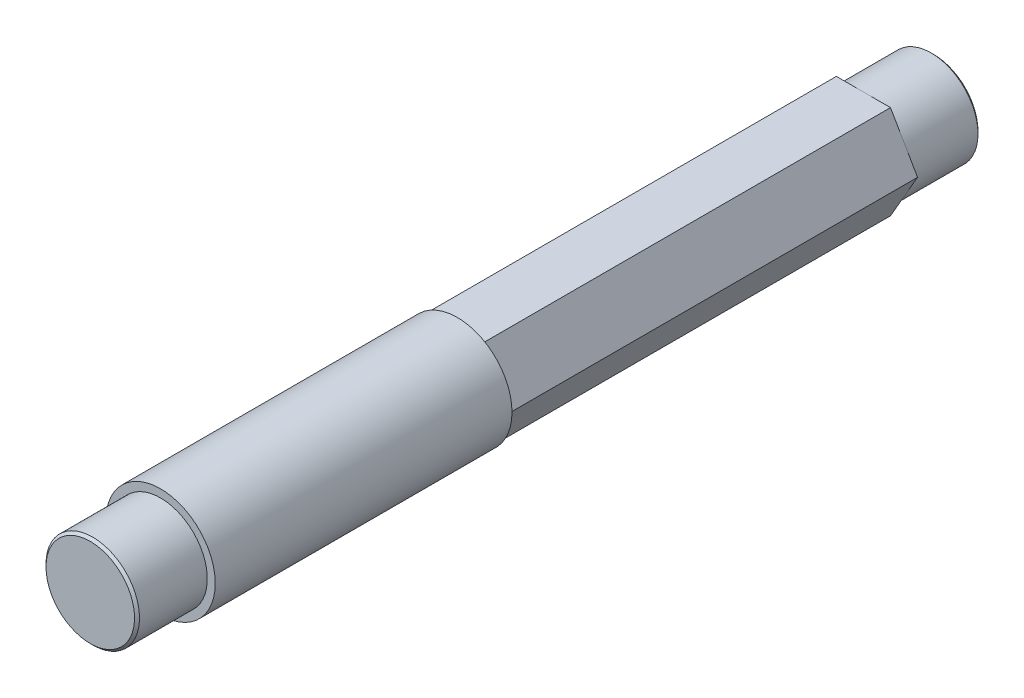
ISO-10303-21;
HEADER;
FILE_DESCRIPTION(('STEP AP214'),'2;1');
FILE_NAME('part.step','',(''),(''),'','','');
FILE_SCHEMA(('AUTOMOTIVE_DESIGN { 1 0 10303 214 1 1 1 1 }'));
ENDSEC;
DATA;
#1=APPLICATION_CONTEXT('core data for automotive mechanical design processes');
#2=APPLICATION_PROTOCOL_DEFINITION('international standard','automotive_design',2000,#1);
#3=PRODUCT_CONTEXT('',#1,'mechanical');
#4=PRODUCT('Part','Part','',(#3));
#5=PRODUCT_RELATED_PRODUCT_CATEGORY('part','',(#4));
#6=PRODUCT_DEFINITION_FORMATION('','',#4);
#7=PRODUCT_DEFINITION_CONTEXT('part definition',#1,'design');
#8=PRODUCT_DEFINITION('design','',#6,#7);
#9=PRODUCT_DEFINITION_SHAPE('','',#8);
#10=(LENGTH_UNIT() NAMED_UNIT(*) SI_UNIT(.MILLI.,.METRE.));
#11=(NAMED_UNIT(*) PLANE_ANGLE_UNIT() SI_UNIT($,.RADIAN.));
#12=(NAMED_UNIT(*) SI_UNIT($,.STERADIAN.) SOLID_ANGLE_UNIT());
#13=UNCERTAINTY_MEASURE_WITH_UNIT(LENGTH_MEASURE(1.E-05),#10,'distance_accuracy_value','');
#14=(GEOMETRIC_REPRESENTATION_CONTEXT(3) GLOBAL_UNCERTAINTY_ASSIGNED_CONTEXT((#13)) GLOBAL_UNIT_ASSIGNED_CONTEXT((#10,
#11,#12)) REPRESENTATION_CONTEXT('',''));
#15=CARTESIAN_POINT('',(0.,0.,0.));
#16=DIRECTION('',(0.,0.,1.));
#17=DIRECTION('',(1.,0.,0.));
#18=AXIS2_PLACEMENT_3D('',#15,#16,#17);
#19=CARTESIAN_POINT('',(0.,0.,-42.8625));
#20=DIRECTION('',(0.,0.,-1.));
#21=DIRECTION('',(-1.,0.,0.));
#22=AXIS2_PLACEMENT_3D('',#19,#20,#21);
#23=PLANE('',#22);
#24=CARTESIAN_POINT('',(0.,0.,-42.8625000000125));
#25=DIRECTION('',(0.,0.,1.));
#26=DIRECTION('',(1.,0.,0.));
#27=AXIS2_PLACEMENT_3D('',#24,#25,#26);
#28=CIRCLE('',#27,4.49980000001915);
#29=CARTESIAN_POINT('',(4.49980000001915,0.,-42.8625000000125));
#30=VERTEX_POINT('',#29);
#31=EDGE_CURVE('E20',#30,#30,#28,.T.);
#32=ORIENTED_EDGE('',*,*,#31,.F.);
#33=EDGE_LOOP('',(#32));
#34=FACE_BOUND('',#33,.T.);
#35=ADVANCED_FACE('F17',(#34),#23,.T.);
#36=CARTESIAN_POINT('',(0.,0.,-42.6125000000752));
#37=DIRECTION('',(0.,0.,1.));
#38=DIRECTION('',(1.,0.,0.));
#39=AXIS2_PLACEMENT_3D('',#36,#37,#38);
#40=CONICAL_SURFACE('',#39,4.74979999995639,0.785398163397448);
#41=CARTESIAN_POINT('',(0.,0.,-42.6125));
#42=DIRECTION('',(0.,0.,1.));
#43=DIRECTION('',(1.,0.,0.));
#44=AXIS2_PLACEMENT_3D('',#41,#42,#43);
#45=CIRCLE('',#44,4.7498);
#46=CARTESIAN_POINT('',(4.7498,0.,-42.6125));
#47=VERTEX_POINT('',#46);
#48=EDGE_CURVE('E102',#47,#47,#45,.T.);
#49=ORIENTED_EDGE('',*,*,#48,.F.);
#50=EDGE_LOOP('',(#49));
#51=FACE_BOUND('',#50,.T.);
#52=ORIENTED_EDGE('',*,*,#31,.T.);
#53=EDGE_LOOP('',(#52));
#54=FACE_BOUND('',#53,.T.);
#55=ADVANCED_FACE('F255',(#51,#54),#40,.T.);
#56=CARTESIAN_POINT('',(0.,0.,-42.8625));
#57=DIRECTION('',(0.,0.,1.));
#58=DIRECTION('',(1.,0.,0.));
#59=AXIS2_PLACEMENT_3D('',#56,#57,#58);
#60=CYLINDRICAL_SURFACE('',#59,4.7498);
#61=CARTESIAN_POINT('',(0.,0.,-35.71875));
#62=DIRECTION('',(0.,0.,1.));
#63=DIRECTION('',(1.,0.,0.));
#64=AXIS2_PLACEMENT_3D('',#61,#62,#63);
#65=CIRCLE('',#64,4.7498);
#66=CARTESIAN_POINT('',(4.7498,0.,-35.71875));
#67=VERTEX_POINT('',#66);
#68=EDGE_CURVE('E104',#67,#67,#65,.F.);
#69=ORIENTED_EDGE('',*,*,#68,.T.);
#70=EDGE_LOOP('',(#69));
#71=FACE_BOUND('',#70,.T.);
#72=ORIENTED_EDGE('',*,*,#48,.T.);
#73=EDGE_LOOP('',(#72));
#74=FACE_BOUND('',#73,.T.);
#75=ADVANCED_FACE('F116',(#71,#74),#60,.T.);
#76=CARTESIAN_POINT('',(0.,0.,42.8625));
#77=DIRECTION('',(0.,0.,1.));
#78=DIRECTION('',(1.,0.,0.));
#79=AXIS2_PLACEMENT_3D('',#76,#77,#78);
#80=PLANE('',#79);
#81=CARTESIAN_POINT('',(0.,0.,42.8625000000125));
#82=DIRECTION('',(0.,0.,-1.));
#83=DIRECTION('',(-1.,0.,0.));
#84=AXIS2_PLACEMENT_3D('',#81,#82,#83);
#85=CIRCLE('',#84,4.49980000001915);
#86=CARTESIAN_POINT('',(-4.49980000001915,0.,42.8625000000125));
#87=VERTEX_POINT('',#86);
#88=EDGE_CURVE('E80',#87,#87,#85,.T.);
#89=ORIENTED_EDGE('',*,*,#88,.F.);
#90=EDGE_LOOP('',(#89));
#91=FACE_BOUND('',#90,.T.);
#92=ADVANCED_FACE('F120',(#91),#80,.T.);
#93=CARTESIAN_POINT('',(0.,0.,-35.71875));
#94=DIRECTION('',(0.,0.,1.));
#95=DIRECTION('',(1.,0.,0.));
#96=AXIS2_PLACEMENT_3D('',#93,#94,#95);
#97=PLANE('',#96);
#98=DIRECTION('',(1.,0.,0.));
#99=VECTOR('',#98,1.);
#100=CARTESIAN_POINT('',(-2.7496306570156,-4.76250000000002,-35.71875));
#101=LINE('',#100,#99);
#102=CARTESIAN_POINT('',(2.74963065701558,-4.76250000000002,-35.71875));
#103=VERTEX_POINT('',#102);
#104=CARTESIAN_POINT('',(-2.7496306570156,-4.76250000000002,-35.71875));
#105=VERTEX_POINT('',#104);
#106=EDGE_CURVE('E76',#103,#105,#101,.F.);
#107=ORIENTED_EDGE('',*,*,#106,.T.);
#108=DIRECTION('',(-0.499999999999999,0.866025403784439,0.));
#109=VECTOR('',#108,1.);
#110=CARTESIAN_POINT('',(-5.49926131403121,0.,-35.71875));
#111=LINE('',#110,#109);
#112=CARTESIAN_POINT('',(-5.49926131403121,0.,-35.71875));
#113=VERTEX_POINT('',#112);
#114=EDGE_CURVE('E71',#105,#113,#111,.T.);
#115=ORIENTED_EDGE('',*,*,#114,.T.);
#116=DIRECTION('',(0.5,0.866025403784439,0.));
#117=VECTOR('',#116,1.);
#118=CARTESIAN_POINT('',(-2.7496306570156,4.76250000000003,-35.71875));
#119=LINE('',#118,#117);
#120=CARTESIAN_POINT('',(-2.7496306570156,4.76250000000003,-35.71875));
#121=VERTEX_POINT('',#120);
#122=EDGE_CURVE('E68',#113,#121,#119,.T.);
#123=ORIENTED_EDGE('',*,*,#122,.T.);
#124=DIRECTION('',(1.,0.,0.));
#125=VECTOR('',#124,1.);
#126=CARTESIAN_POINT('',(2.74963065701557,4.76250000000003,-35.71875));
#127=LINE('',#126,#125);
#128=CARTESIAN_POINT('',(2.74963065701557,4.76250000000003,-35.71875));
#129=VERTEX_POINT('',#128);
#130=EDGE_CURVE('E94',#121,#129,#127,.T.);
#131=ORIENTED_EDGE('',*,*,#130,.T.);
#132=DIRECTION('',(0.5,-0.866025403784439,0.));
#133=VECTOR('',#132,1.);
#134=CARTESIAN_POINT('',(5.49926131403118,0.,-35.71875));
#135=LINE('',#134,#133);
#136=CARTESIAN_POINT('',(5.49926131403118,0.,-35.71875));
#137=VERTEX_POINT('',#136);
#138=EDGE_CURVE('E291',#129,#137,#135,.T.);
#139=ORIENTED_EDGE('',*,*,#138,.T.);
#140=DIRECTION('',(-0.499999999999999,-0.866025403784439,0.));
#141=VECTOR('',#140,1.);
#142=CARTESIAN_POINT('',(2.74963065701558,-4.76250000000002,-35.71875));
#143=LINE('',#142,#141);
#144=EDGE_CURVE('E297',#137,#103,#143,.T.);
#145=ORIENTED_EDGE('',*,*,#144,.T.);
#146=EDGE_LOOP('',(#107,#115,#123,#131,#139,#145));
#147=FACE_BOUND('',#146,.T.);
#148=ORIENTED_EDGE('',*,*,#68,.F.);
#149=EDGE_LOOP('',(#148));
#150=FACE_BOUND('',#149,.T.);
#151=ADVANCED_FACE('F73',(#147,#150),#97,.F.);
#152=CARTESIAN_POINT('',(0.,0.,42.6125000000752));
#153=DIRECTION('',(0.,0.,-1.));
#154=DIRECTION('',(-1.,0.,0.));
#155=AXIS2_PLACEMENT_3D('',#152,#153,#154);
#156=CONICAL_SURFACE('',#155,4.74979999995639,0.785398163397448);
#157=CARTESIAN_POINT('',(0.,0.,42.6125));
#158=DIRECTION('',(0.,0.,-1.));
#159=DIRECTION('',(-1.,0.,0.));
#160=AXIS2_PLACEMENT_3D('',#157,#158,#159);
#161=CIRCLE('',#160,4.7498);
#162=CARTESIAN_POINT('',(-4.7498,0.,42.6125));
#163=VERTEX_POINT('',#162);
#164=EDGE_CURVE('E98',#163,#163,#161,.T.);
#165=ORIENTED_EDGE('',*,*,#164,.F.);
#166=EDGE_LOOP('',(#165));
#167=FACE_BOUND('',#166,.T.);
#168=ORIENTED_EDGE('',*,*,#88,.T.);
#169=EDGE_LOOP('',(#168));
#170=FACE_BOUND('',#169,.T.);
#171=ADVANCED_FACE('F119',(#167,#170),#156,.T.);
#172=CARTESIAN_POINT('',(-5.49926131403121,0.,35.71875));
#173=DIRECTION('',(0.866025403784439,0.499999999999999,0.));
#174=DIRECTION('',(-0.499999999999999,0.866025403784439,0.));
#175=AXIS2_PLACEMENT_3D('',#172,#173,#174);
#176=PLANE('',#175);
#177=DIRECTION('',(0.,0.,1.));
#178=VECTOR('',#177,1.);
#179=CARTESIAN_POINT('',(-5.49926131403121,0.,35.71875));
#180=LINE('',#179,#178);
#181=CARTESIAN_POINT('',(-5.49926131403121,0.,5.55625));
#182=VERTEX_POINT('',#181);
#183=EDGE_CURVE('E79',#182,#113,#180,.F.);
#184=ORIENTED_EDGE('',*,*,#183,.T.);
#185=ORIENTED_EDGE('',*,*,#114,.F.);
#186=DIRECTION('',(0.,0.,1.));
#187=VECTOR('',#186,1.);
#188=CARTESIAN_POINT('',(-2.7496306570156,-4.76250000000002,35.71875));
#189=LINE('',#188,#187);
#190=CARTESIAN_POINT('',(-2.7496306570156,-4.76250000000002,5.55625));
#191=VERTEX_POINT('',#190);
#192=EDGE_CURVE('E101',#105,#191,#189,.T.);
#193=ORIENTED_EDGE('',*,*,#192,.T.);
#194=DIRECTION('',(-0.5,0.866025403784439,0.));
#195=VECTOR('',#194,1.);
#196=CARTESIAN_POINT('',(-2.7496306570156,-4.76250000000002,5.55625));
#197=LINE('',#196,#195);
#198=EDGE_CURVE('E85',#191,#182,#197,.T.);
#199=ORIENTED_EDGE('',*,*,#198,.T.);
#200=EDGE_LOOP('',(#184,#185,#193,#199));
#201=FACE_BOUND('',#200,.T.);
#202=ADVANCED_FACE('F83',(#201),#176,.F.);
#203=CARTESIAN_POINT('',(-2.7496306570156,4.76250000000003,35.71875));
#204=DIRECTION('',(0.866025403784439,-0.5,0.));
#205=DIRECTION('',(0.5,0.866025403784439,0.));
#206=AXIS2_PLACEMENT_3D('',#203,#204,#205);
#207=PLANE('',#206);
#208=DIRECTION('',(0.,0.,-1.));
#209=VECTOR('',#208,1.);
#210=CARTESIAN_POINT('',(-2.7496306570156,4.76250000000003,35.71875));
#211=LINE('',#210,#209);
#212=CARTESIAN_POINT('',(-2.7496306570156,4.76250000000003,5.55625));
#213=VERTEX_POINT('',#212);
#214=EDGE_CURVE('E91',#213,#121,#211,.T.);
#215=ORIENTED_EDGE('',*,*,#214,.T.);
#216=ORIENTED_EDGE('',*,*,#122,.F.);
#217=ORIENTED_EDGE('',*,*,#183,.F.);
#218=DIRECTION('',(0.5,0.866025403784439,0.));
#219=VECTOR('',#218,1.);
#220=CARTESIAN_POINT('',(-5.49926131403121,0.,5.55625));
#221=LINE('',#220,#219);
#222=EDGE_CURVE('E306',#182,#213,#221,.T.);
#223=ORIENTED_EDGE('',*,*,#222,.T.);
#224=EDGE_LOOP('',(#215,#216,#217,#223));
#225=FACE_BOUND('',#224,.T.);
#226=ADVANCED_FACE('F89',(#225),#207,.F.);
#227=CARTESIAN_POINT('',(2.74963065701557,4.76250000000003,35.71875));
#228=DIRECTION('',(0.,-1.,0.));
#229=DIRECTION('',(0.,0.,-1.));
#230=AXIS2_PLACEMENT_3D('',#227,#228,#229);
#231=PLANE('',#230);
#232=DIRECTION('',(0.,0.,1.));
#233=VECTOR('',#232,1.);
#234=CARTESIAN_POINT('',(2.74963065701557,4.76250000000003,35.71875));
#235=LINE('',#234,#233);
#236=CARTESIAN_POINT('',(2.74963065701557,4.76250000000003,5.55625));
#237=VERTEX_POINT('',#236);
#238=EDGE_CURVE('E286',#237,#129,#235,.F.);
#239=ORIENTED_EDGE('',*,*,#238,.T.);
#240=ORIENTED_EDGE('',*,*,#130,.F.);
#241=ORIENTED_EDGE('',*,*,#214,.F.);
#242=DIRECTION('',(1.,0.,0.));
#243=VECTOR('',#242,1.);
#244=CARTESIAN_POINT('',(0.,4.76250000000003,5.55625));
#245=LINE('',#244,#243);
#246=EDGE_CURVE('E289',#213,#237,#245,.T.);
#247=ORIENTED_EDGE('',*,*,#246,.T.);
#248=EDGE_LOOP('',(#239,#240,#241,#247));
#249=FACE_BOUND('',#248,.T.);
#250=ADVANCED_FACE('F161',(#249),#231,.F.);
#251=CARTESIAN_POINT('',(5.49926131403118,0.,35.71875));
#252=DIRECTION('',(-0.866025403784439,-0.5,0.));
#253=DIRECTION('',(0.5,-0.866025403784439,0.));
#254=AXIS2_PLACEMENT_3D('',#251,#252,#253);
#255=PLANE('',#254);
#256=DIRECTION('',(0.,0.,1.));
#257=VECTOR('',#256,1.);
#258=CARTESIAN_POINT('',(5.49926131403118,0.,35.71875));
#259=LINE('',#258,#257);
#260=CARTESIAN_POINT('',(5.49926131403118,0.,5.55624999999999));
#261=VERTEX_POINT('',#260);
#262=EDGE_CURVE('E294',#261,#137,#259,.F.);
#263=ORIENTED_EDGE('',*,*,#262,.T.);
#264=ORIENTED_EDGE('',*,*,#138,.F.);
#265=ORIENTED_EDGE('',*,*,#238,.F.);
#266=DIRECTION('',(0.5,-0.866025403784439,0.));
#267=VECTOR('',#266,1.);
#268=CARTESIAN_POINT('',(2.74963065701557,4.76250000000003,5.55625));
#269=LINE('',#268,#267);
#270=EDGE_CURVE('E309',#237,#261,#269,.T.);
#271=ORIENTED_EDGE('',*,*,#270,.T.);
#272=EDGE_LOOP('',(#263,#264,#265,#271));
#273=FACE_BOUND('',#272,.T.);
#274=ADVANCED_FACE('F158',(#273),#255,.F.);
#275=CARTESIAN_POINT('',(2.74963065701558,-4.76250000000002,35.71875));
#276=DIRECTION('',(-0.866025403784439,0.499999999999999,0.));
#277=DIRECTION('',(-0.499999999999999,-0.866025403784439,0.));
#278=AXIS2_PLACEMENT_3D('',#275,#276,#277);
#279=PLANE('',#278);
#280=DIRECTION('',(0.,0.,1.));
#281=VECTOR('',#280,1.);
#282=CARTESIAN_POINT('',(2.74963065701558,-4.76250000000002,35.71875));
#283=LINE('',#282,#281);
#284=CARTESIAN_POINT('',(2.74963065701558,-4.76250000000002,5.55624999999999));
#285=VERTEX_POINT('',#284);
#286=EDGE_CURVE('E301',#285,#103,#283,.F.);
#287=ORIENTED_EDGE('',*,*,#286,.T.);
#288=ORIENTED_EDGE('',*,*,#144,.F.);
#289=ORIENTED_EDGE('',*,*,#262,.F.);
#290=DIRECTION('',(-0.499999999999999,-0.866025403784439,0.));
#291=VECTOR('',#290,1.);
#292=CARTESIAN_POINT('',(5.49926131403118,0.,5.55625));
#293=LINE('',#292,#291);
#294=EDGE_CURVE('E35',#261,#285,#293,.T.);
#295=ORIENTED_EDGE('',*,*,#294,.T.);
#296=EDGE_LOOP('',(#287,#288,#289,#295));
#297=FACE_BOUND('',#296,.T.);
#298=ADVANCED_FACE('F154',(#297),#279,.F.);
#299=CARTESIAN_POINT('',(-2.7496306570156,-4.76250000000002,35.71875));
#300=DIRECTION('',(0.,1.,0.));
#301=DIRECTION('',(0.,0.,1.));
#302=AXIS2_PLACEMENT_3D('',#299,#300,#301);
#303=PLANE('',#302);
#304=ORIENTED_EDGE('',*,*,#192,.F.);
#305=ORIENTED_EDGE('',*,*,#106,.F.);
#306=ORIENTED_EDGE('',*,*,#286,.F.);
#307=DIRECTION('',(1.,0.,0.));
#308=VECTOR('',#307,1.);
#309=CARTESIAN_POINT('',(0.,-4.76250000000002,5.55625));
#310=LINE('',#309,#308);
#311=EDGE_CURVE('E111',#285,#191,#310,.F.);
#312=ORIENTED_EDGE('',*,*,#311,.T.);
#313=EDGE_LOOP('',(#304,#305,#306,#312));
#314=FACE_BOUND('',#313,.T.);
#315=ADVANCED_FACE('F150',(#314),#303,.F.);
#316=CARTESIAN_POINT('',(0.,0.,42.8625));
#317=DIRECTION('',(0.,0.,-1.));
#318=DIRECTION('',(-1.,0.,0.));
#319=AXIS2_PLACEMENT_3D('',#316,#317,#318);
#320=CYLINDRICAL_SURFACE('',#319,4.7498);
#321=CARTESIAN_POINT('',(0.,0.,35.71875));
#322=DIRECTION('',(0.,0.,-1.));
#323=DIRECTION('',(-1.,0.,0.));
#324=AXIS2_PLACEMENT_3D('',#321,#322,#323);
#325=CIRCLE('',#324,4.7498);
#326=CARTESIAN_POINT('',(-4.7498,0.,35.71875));
#327=VERTEX_POINT('',#326);
#328=EDGE_CURVE('E108',#327,#327,#325,.T.);
#329=ORIENTED_EDGE('',*,*,#328,.F.);
#330=EDGE_LOOP('',(#329));
#331=FACE_BOUND('',#330,.T.);
#332=ORIENTED_EDGE('',*,*,#164,.T.);
#333=EDGE_LOOP('',(#332));
#334=FACE_BOUND('',#333,.T.);
#335=ADVANCED_FACE('F146',(#331,#334),#320,.T.);
#336=CARTESIAN_POINT('',(0.,0.,5.55625));
#337=DIRECTION('',(0.,0.,1.));
#338=DIRECTION('',(1.,0.,0.));
#339=AXIS2_PLACEMENT_3D('',#336,#337,#338);
#340=PLANE('',#339);
#341=ORIENTED_EDGE('',*,*,#294,.F.);
#342=ORIENTED_EDGE('',*,*,#270,.F.);
#343=ORIENTED_EDGE('',*,*,#246,.F.);
#344=ORIENTED_EDGE('',*,*,#222,.F.);
#345=ORIENTED_EDGE('',*,*,#198,.F.);
#346=ORIENTED_EDGE('',*,*,#311,.F.);
#347=EDGE_LOOP('',(#341,#342,#343,#344,#345,#346));
#348=FACE_BOUND('',#347,.T.);
#349=CARTESIAN_POINT('',(0.,0.,5.55625));
#350=DIRECTION('',(0.,0.,1.));
#351=DIRECTION('',(1.,0.,0.));
#352=AXIS2_PLACEMENT_3D('',#349,#350,#351);
#353=CIRCLE('',#352,5.55625);
#354=CARTESIAN_POINT('',(5.55625,0.,5.55625));
#355=VERTEX_POINT('',#354);
#356=EDGE_CURVE('E26',#355,#355,#353,.T.);
#357=ORIENTED_EDGE('',*,*,#356,.F.);
#358=EDGE_LOOP('',(#357));
#359=FACE_BOUND('',#358,.T.);
#360=ADVANCED_FACE('F139',(#348,#359),#340,.F.);
#361=CARTESIAN_POINT('',(0.,0.,35.71875));
#362=DIRECTION('',(0.,0.,1.));
#363=DIRECTION('',(1.,0.,0.));
#364=AXIS2_PLACEMENT_3D('',#361,#362,#363);
#365=PLANE('',#364);
#366=CARTESIAN_POINT('',(0.,0.,35.71875));
#367=DIRECTION('',(0.,0.,1.));
#368=DIRECTION('',(1.,0.,0.));
#369=AXIS2_PLACEMENT_3D('',#366,#367,#368);
#370=CIRCLE('',#369,5.55625);
#371=CARTESIAN_POINT('',(5.55625,0.,35.71875));
#372=VERTEX_POINT('',#371);
#373=EDGE_CURVE('E11',#372,#372,#370,.F.);
#374=ORIENTED_EDGE('',*,*,#373,.F.);
#375=EDGE_LOOP('',(#374));
#376=FACE_BOUND('',#375,.T.);
#377=ORIENTED_EDGE('',*,*,#328,.T.);
#378=EDGE_LOOP('',(#377));
#379=FACE_BOUND('',#378,.T.);
#380=ADVANCED_FACE('F133',(#376,#379),#365,.T.);
#381=CARTESIAN_POINT('',(0.,0.,5.55625));
#382=DIRECTION('',(0.,0.,1.));
#383=DIRECTION('',(1.,0.,0.));
#384=AXIS2_PLACEMENT_3D('',#381,#382,#383);
#385=CYLINDRICAL_SURFACE('',#384,5.55625);
#386=ORIENTED_EDGE('',*,*,#373,.T.);
#387=EDGE_LOOP('',(#386));
#388=FACE_BOUND('',#387,.T.);
#389=ORIENTED_EDGE('',*,*,#356,.T.);
#390=EDGE_LOOP('',(#389));
#391=FACE_BOUND('',#390,.T.);
#392=ADVANCED_FACE('F131',(#388,#391),#385,.T.);
#393=CLOSED_SHELL('',(#35,#55,#75,#92,#151,#171,#202,#226,#250,#274,#298,#315,#335,#360,#380,#392));
#394=MANIFOLD_SOLID_BREP('B1',#393);
#395=ADVANCED_BREP_SHAPE_REPRESENTATION('',(#18,#394),#14);
#396=SHAPE_DEFINITION_REPRESENTATION(#9,#395);
ENDSEC;
END-ISO-10303-21;
